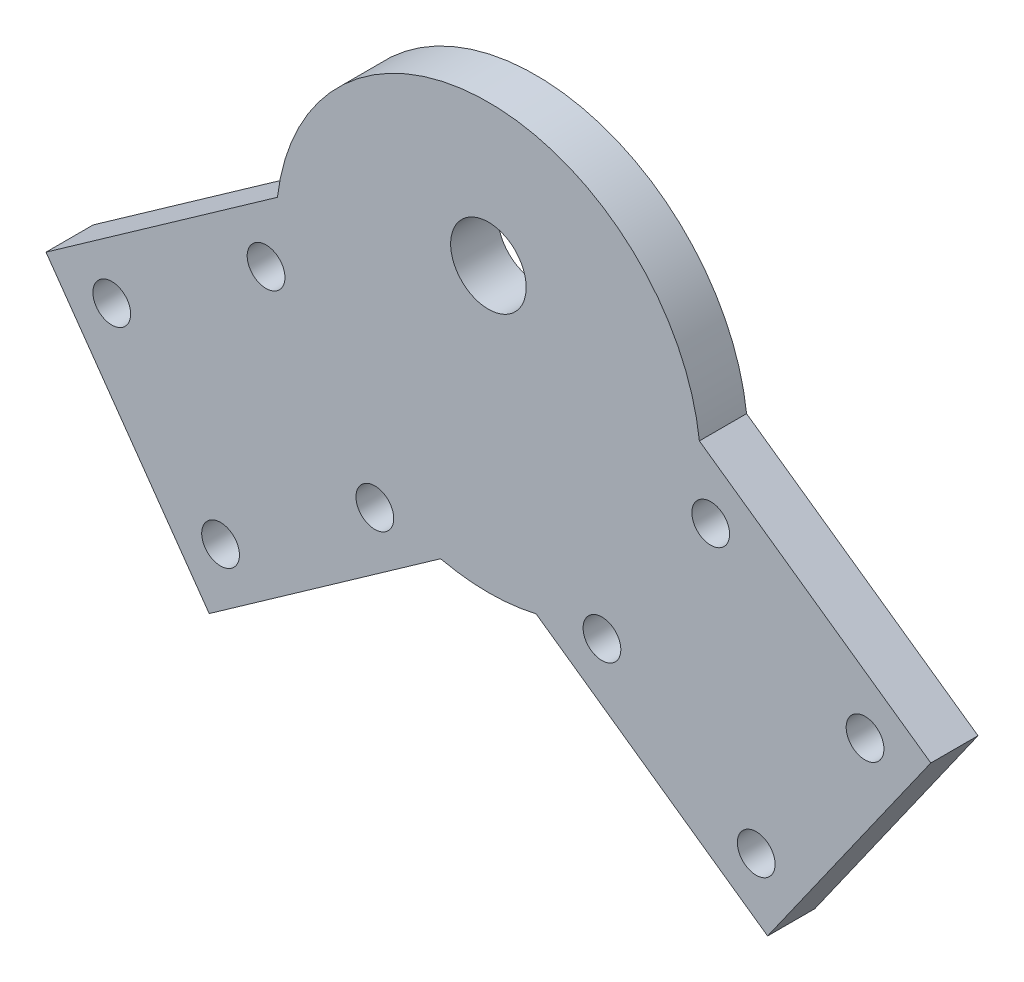
ISO-10303-21;
HEADER;
FILE_DESCRIPTION(('STEP AP214'),'2;1');
FILE_NAME('part.step','',(''),(''),'','','');
FILE_SCHEMA(('AUTOMOTIVE_DESIGN { 1 0 10303 214 1 1 1 1 }'));
ENDSEC;
DATA;
#1=APPLICATION_CONTEXT('core data for automotive mechanical design processes');
#2=APPLICATION_PROTOCOL_DEFINITION('international standard','automotive_design',2000,#1);
#3=PRODUCT_CONTEXT('',#1,'mechanical');
#4=PRODUCT('Part','Part','',(#3));
#5=PRODUCT_RELATED_PRODUCT_CATEGORY('part','',(#4));
#6=PRODUCT_DEFINITION_FORMATION('','',#4);
#7=PRODUCT_DEFINITION_CONTEXT('part definition',#1,'design');
#8=PRODUCT_DEFINITION('design','',#6,#7);
#9=PRODUCT_DEFINITION_SHAPE('','',#8);
#10=(LENGTH_UNIT() NAMED_UNIT(*) SI_UNIT(.MILLI.,.METRE.));
#11=(NAMED_UNIT(*) PLANE_ANGLE_UNIT() SI_UNIT($,.RADIAN.));
#12=(NAMED_UNIT(*) SI_UNIT($,.STERADIAN.) SOLID_ANGLE_UNIT());
#13=UNCERTAINTY_MEASURE_WITH_UNIT(LENGTH_MEASURE(1.E-05),#10,'distance_accuracy_value','');
#14=(GEOMETRIC_REPRESENTATION_CONTEXT(3) GLOBAL_UNCERTAINTY_ASSIGNED_CONTEXT((#13)) GLOBAL_UNIT_ASSIGNED_CONTEXT((#10,
#11,#12)) REPRESENTATION_CONTEXT('',''));
#15=CARTESIAN_POINT('',(0.,0.,0.));
#16=DIRECTION('',(0.,0.,1.));
#17=DIRECTION('',(1.,0.,0.));
#18=AXIS2_PLACEMENT_3D('',#15,#16,#17);
#19=CARTESIAN_POINT('',(0.,0.,0.));
#20=DIRECTION('',(0.,0.,1.));
#21=DIRECTION('',(1.,0.,0.));
#22=AXIS2_PLACEMENT_3D('',#19,#20,#21);
#23=PLANE('',#22);
#24=CARTESIAN_POINT('',(0.,7.5,0.));
#25=DIRECTION('',(0.,0.,1.));
#26=DIRECTION('',(1.,0.,0.));
#27=AXIS2_PLACEMENT_3D('',#24,#25,#26);
#28=CIRCLE('',#27,4.);
#29=CARTESIAN_POINT('',(4.,7.5,0.));
#30=VERTEX_POINT('',#29);
#31=EDGE_CURVE('E247',#30,#30,#28,.T.);
#32=ORIENTED_EDGE('',*,*,#31,.T.);
#33=EDGE_LOOP('',(#32));
#34=FACE_BOUND('',#33,.T.);
#35=CARTESIAN_POINT('',(-39.8997451402914,-15.8992398969955,0.));
#36=DIRECTION('',(0.,0.,1.));
#37=DIRECTION('',(1.,0.,0.));
#38=AXIS2_PLACEMENT_3D('',#35,#36,#37);
#39=CIRCLE('',#38,2.);
#40=CARTESIAN_POINT('',(-37.8997451402914,-15.8992398969955,0.));
#41=VERTEX_POINT('',#40);
#42=EDGE_CURVE('E154',#41,#41,#39,.T.);
#43=ORIENTED_EDGE('',*,*,#42,.T.);
#44=EDGE_LOOP('',(#43));
#45=FACE_BOUND('',#44,.T.);
#46=CARTESIAN_POINT('',(12.0290680062479,-20.7185091455333,0.));
#47=DIRECTION('',(0.,0.,1.));
#48=DIRECTION('',(1.,0.,0.));
#49=AXIS2_PLACEMENT_3D('',#46,#47,#48);
#50=CIRCLE('',#49,2.);
#51=CARTESIAN_POINT('',(14.0290680062479,-20.7185091455333,0.));
#52=VERTEX_POINT('',#51);
#53=EDGE_CURVE('E213',#52,#52,#50,.T.);
#54=ORIENTED_EDGE('',*,*,#53,.T.);
#55=EDGE_LOOP('',(#54));
#56=FACE_BOUND('',#55,.T.);
#57=CARTESIAN_POINT('',(-28.3740411975385,-32.2442130882862,0.));
#58=DIRECTION('',(0.,0.,1.));
#59=DIRECTION('',(1.,0.,0.));
#60=AXIS2_PLACEMENT_3D('',#57,#58,#59);
#61=CIRCLE('',#60,2.00000000000001);
#62=CARTESIAN_POINT('',(-26.3740411975385,-32.2442130882862,0.));
#63=VERTEX_POINT('',#62);
#64=EDGE_CURVE('E217',#63,#63,#61,.T.);
#65=ORIENTED_EDGE('',*,*,#64,.T.);
#66=EDGE_LOOP('',(#65));
#67=FACE_BOUND('',#66,.T.);
#68=CARTESIAN_POINT('',(-12.0290680062479,-20.7185091455333,0.));
#69=DIRECTION('',(0.,0.,1.));
#70=DIRECTION('',(1.,0.,0.));
#71=AXIS2_PLACEMENT_3D('',#68,#69,#70);
#72=CIRCLE('',#71,2.);
#73=CARTESIAN_POINT('',(-10.0290680062479,-20.7185091455333,0.));
#74=VERTEX_POINT('',#73);
#75=EDGE_CURVE('E221',#74,#74,#72,.T.);
#76=ORIENTED_EDGE('',*,*,#75,.T.);
#77=EDGE_LOOP('',(#76));
#78=FACE_BOUND('',#77,.T.);
#79=CARTESIAN_POINT('',(-23.5547719490007,-4.37353595424265,0.));
#80=DIRECTION('',(0.,0.,1.));
#81=DIRECTION('',(1.,0.,0.));
#82=AXIS2_PLACEMENT_3D('',#79,#80,#81);
#83=CIRCLE('',#82,2.);
#84=CARTESIAN_POINT('',(-21.5547719490007,-4.37353595424265,0.));
#85=VERTEX_POINT('',#84);
#86=EDGE_CURVE('E225',#85,#85,#83,.T.);
#87=ORIENTED_EDGE('',*,*,#86,.T.);
#88=EDGE_LOOP('',(#87));
#89=FACE_BOUND('',#88,.T.);
#90=CARTESIAN_POINT('',(23.5547719490007,-4.37353595424265,0.));
#91=DIRECTION('',(0.,0.,1.));
#92=DIRECTION('',(1.,0.,0.));
#93=AXIS2_PLACEMENT_3D('',#90,#91,#92);
#94=CIRCLE('',#93,2.);
#95=CARTESIAN_POINT('',(25.5547719490007,-4.37353595424265,0.));
#96=VERTEX_POINT('',#95);
#97=EDGE_CURVE('E229',#96,#96,#94,.T.);
#98=ORIENTED_EDGE('',*,*,#97,.T.);
#99=EDGE_LOOP('',(#98));
#100=FACE_BOUND('',#99,.T.);
#101=CARTESIAN_POINT('',(39.8997451402914,-15.8992398969955,0.));
#102=DIRECTION('',(0.,0.,1.));
#103=DIRECTION('',(1.,0.,0.));
#104=AXIS2_PLACEMENT_3D('',#101,#102,#103);
#105=CIRCLE('',#104,2.);
#106=CARTESIAN_POINT('',(41.8997451402914,-15.8992398969955,0.));
#107=VERTEX_POINT('',#106);
#108=EDGE_CURVE('E233',#107,#107,#105,.T.);
#109=ORIENTED_EDGE('',*,*,#108,.T.);
#110=EDGE_LOOP('',(#109));
#111=FACE_BOUND('',#110,.T.);
#112=CARTESIAN_POINT('',(28.3740411975385,-32.2442130882862,0.));
#113=DIRECTION('',(0.,0.,1.));
#114=DIRECTION('',(1.,0.,0.));
#115=AXIS2_PLACEMENT_3D('',#112,#113,#114);
#116=CIRCLE('',#115,2.00000000000001);
#117=CARTESIAN_POINT('',(30.3740411975386,-32.2442130882862,0.));
#118=VERTEX_POINT('',#117);
#119=EDGE_CURVE('E237',#118,#118,#116,.T.);
#120=ORIENTED_EDGE('',*,*,#119,.T.);
#121=EDGE_LOOP('',(#120));
#122=FACE_BOUND('',#121,.T.);
#123=CARTESIAN_POINT('',(0.,0.,0.));
#124=DIRECTION('',(0.,0.,1.));
#125=DIRECTION('',(1.,0.,0.));
#126=AXIS2_PLACEMENT_3D('',#123,#124,#125);
#127=CIRCLE('',#126,22.5);
#128=CARTESIAN_POINT('',(22.3499546368663,2.59413332926824,0.));
#129=VERTEX_POINT('',#128);
#130=CARTESIAN_POINT('',(-22.3499546368663,2.59413332926824,0.));
#131=VERTEX_POINT('',#130);
#132=EDGE_CURVE('E202',#129,#131,#127,.T.);
#133=ORIENTED_EDGE('',*,*,#132,.F.);
#134=DIRECTION('',(0.817248659564534,-0.576285197137643,0.));
#135=VECTOR('',#134,1.);
#136=CARTESIAN_POINT('',(22.3499546368663,2.59413332926824,0.));
#137=LINE('',#136,#135);
#138=CARTESIAN_POINT('',(46.8674144238023,-14.6944225848611,0.));
#139=VERTEX_POINT('',#138);
#140=EDGE_CURVE('E150',#129,#139,#137,.T.);
#141=ORIENTED_EDGE('',*,*,#140,.T.);
#142=DIRECTION('',(0.576285197137643,0.817248659564534,0.));
#143=VECTOR('',#142,1.);
#144=CARTESIAN_POINT('',(29.578858509673,-39.2118823717971,0.));
#145=LINE('',#144,#143);
#146=CARTESIAN_POINT('',(29.578858509673,-39.2118823717971,0.));
#147=VERTEX_POINT('',#146);
#148=EDGE_CURVE('E141',#147,#139,#145,.T.);
#149=ORIENTED_EDGE('',*,*,#148,.F.);
#150=DIRECTION('',(0.817248659564534,-0.576285197137643,0.));
#151=VECTOR('',#150,1.);
#152=CARTESIAN_POINT('',(5.06139872273697,-21.9233264576678,0.));
#153=LINE('',#152,#151);
#154=CARTESIAN_POINT('',(5.06139872273697,-21.9233264576678,0.));
#155=VERTEX_POINT('',#154);
#156=EDGE_CURVE('E130',#155,#147,#153,.T.);
#157=ORIENTED_EDGE('',*,*,#156,.F.);
#158=CARTESIAN_POINT('',(-5.06139872273697,-21.9233264576678,0.));
#159=VERTEX_POINT('',#158);
#160=EDGE_CURVE('E167',#159,#155,#127,.T.);
#161=ORIENTED_EDGE('',*,*,#160,.F.);
#162=DIRECTION('',(-0.817248659564534,-0.576285197137643,0.));
#163=VECTOR('',#162,1.);
#164=CARTESIAN_POINT('',(-5.06139872273697,-21.9233264576678,0.));
#165=LINE('',#164,#163);
#166=CARTESIAN_POINT('',(-29.578858509673,-39.2118823717971,0.));
#167=VERTEX_POINT('',#166);
#168=EDGE_CURVE('E172',#159,#167,#165,.T.);
#169=ORIENTED_EDGE('',*,*,#168,.T.);
#170=DIRECTION('',(-0.576285197137643,0.817248659564534,0.));
#171=VECTOR('',#170,1.);
#172=CARTESIAN_POINT('',(-29.578858509673,-39.2118823717971,0.));
#173=LINE('',#172,#171);
#174=CARTESIAN_POINT('',(-46.8674144238023,-14.6944225848611,0.));
#175=VERTEX_POINT('',#174);
#176=EDGE_CURVE('E177',#167,#175,#173,.T.);
#177=ORIENTED_EDGE('',*,*,#176,.T.);
#178=DIRECTION('',(-0.817248659564534,-0.576285197137643,0.));
#179=VECTOR('',#178,1.);
#180=CARTESIAN_POINT('',(-22.3499546368663,2.59413332926823,0.));
#181=LINE('',#180,#179);
#182=EDGE_CURVE('E148',#131,#175,#181,.T.);
#183=ORIENTED_EDGE('',*,*,#182,.F.);
#184=EDGE_LOOP('',(#133,#141,#149,#157,#161,#169,#177,#183));
#185=FACE_BOUND('',#184,.T.);
#186=ADVANCED_FACE('F74',(#34,#45,#56,#67,#78,#89,#100,#111,#122,#185),#23,.F.);
#187=CARTESIAN_POINT('',(0.,0.,5.));
#188=DIRECTION('',(0.,0.,1.));
#189=DIRECTION('',(1.,0.,0.));
#190=AXIS2_PLACEMENT_3D('',#187,#188,#189);
#191=PLANE('',#190);
#192=CARTESIAN_POINT('',(0.,7.5,5.));
#193=DIRECTION('',(0.,0.,1.));
#194=DIRECTION('',(1.,0.,0.));
#195=AXIS2_PLACEMENT_3D('',#192,#193,#194);
#196=CIRCLE('',#195,4.);
#197=CARTESIAN_POINT('',(4.,7.5,5.));
#198=VERTEX_POINT('',#197);
#199=EDGE_CURVE('E277',#198,#198,#196,.T.);
#200=ORIENTED_EDGE('',*,*,#199,.F.);
#201=EDGE_LOOP('',(#200));
#202=FACE_BOUND('',#201,.T.);
#203=CARTESIAN_POINT('',(-39.8997451402914,-15.8992398969955,5.));
#204=DIRECTION('',(0.,0.,1.));
#205=DIRECTION('',(1.,0.,0.));
#206=AXIS2_PLACEMENT_3D('',#203,#204,#205);
#207=CIRCLE('',#206,2.);
#208=CARTESIAN_POINT('',(-37.8997451402914,-15.8992398969955,5.));
#209=VERTEX_POINT('',#208);
#210=EDGE_CURVE('E241',#209,#209,#207,.T.);
#211=ORIENTED_EDGE('',*,*,#210,.F.);
#212=EDGE_LOOP('',(#211));
#213=FACE_BOUND('',#212,.T.);
#214=CARTESIAN_POINT('',(12.0290680062479,-20.7185091455333,5.));
#215=DIRECTION('',(0.,0.,1.));
#216=DIRECTION('',(1.,0.,0.));
#217=AXIS2_PLACEMENT_3D('',#214,#215,#216);
#218=CIRCLE('',#217,2.);
#219=CARTESIAN_POINT('',(14.0290680062479,-20.7185091455333,5.));
#220=VERTEX_POINT('',#219);
#221=EDGE_CURVE('E255',#220,#220,#218,.T.);
#222=ORIENTED_EDGE('',*,*,#221,.F.);
#223=EDGE_LOOP('',(#222));
#224=FACE_BOUND('',#223,.T.);
#225=CARTESIAN_POINT('',(-28.3740411975385,-32.2442130882862,5.));
#226=DIRECTION('',(0.,0.,1.));
#227=DIRECTION('',(1.,0.,0.));
#228=AXIS2_PLACEMENT_3D('',#225,#226,#227);
#229=CIRCLE('',#228,2.00000000000001);
#230=CARTESIAN_POINT('',(-26.3740411975385,-32.2442130882862,5.));
#231=VERTEX_POINT('',#230);
#232=EDGE_CURVE('E261',#231,#231,#229,.T.);
#233=ORIENTED_EDGE('',*,*,#232,.F.);
#234=EDGE_LOOP('',(#233));
#235=FACE_BOUND('',#234,.T.);
#236=CARTESIAN_POINT('',(-12.0290680062479,-20.7185091455333,5.));
#237=DIRECTION('',(0.,0.,1.));
#238=DIRECTION('',(1.,0.,0.));
#239=AXIS2_PLACEMENT_3D('',#236,#237,#238);
#240=CIRCLE('',#239,2.);
#241=CARTESIAN_POINT('',(-10.0290680062479,-20.7185091455333,5.));
#242=VERTEX_POINT('',#241);
#243=EDGE_CURVE('E256',#242,#242,#240,.T.);
#244=ORIENTED_EDGE('',*,*,#243,.F.);
#245=EDGE_LOOP('',(#244));
#246=FACE_BOUND('',#245,.T.);
#247=CARTESIAN_POINT('',(-23.5547719490007,-4.37353595424265,5.));
#248=DIRECTION('',(0.,0.,1.));
#249=DIRECTION('',(1.,0.,0.));
#250=AXIS2_PLACEMENT_3D('',#247,#248,#249);
#251=CIRCLE('',#250,2.);
#252=CARTESIAN_POINT('',(-21.5547719490007,-4.37353595424265,5.));
#253=VERTEX_POINT('',#252);
#254=EDGE_CURVE('E260',#253,#253,#251,.T.);
#255=ORIENTED_EDGE('',*,*,#254,.F.);
#256=EDGE_LOOP('',(#255));
#257=FACE_BOUND('',#256,.T.);
#258=CARTESIAN_POINT('',(23.5547719490007,-4.37353595424265,5.));
#259=DIRECTION('',(0.,0.,1.));
#260=DIRECTION('',(1.,0.,0.));
#261=AXIS2_PLACEMENT_3D('',#258,#259,#260);
#262=CIRCLE('',#261,2.);
#263=CARTESIAN_POINT('',(25.5547719490007,-4.37353595424265,5.));
#264=VERTEX_POINT('',#263);
#265=EDGE_CURVE('E251',#264,#264,#262,.T.);
#266=ORIENTED_EDGE('',*,*,#265,.F.);
#267=EDGE_LOOP('',(#266));
#268=FACE_BOUND('',#267,.T.);
#269=CARTESIAN_POINT('',(39.8997451402914,-15.8992398969955,5.));
#270=DIRECTION('',(0.,0.,1.));
#271=DIRECTION('',(1.,0.,0.));
#272=AXIS2_PLACEMENT_3D('',#269,#270,#271);
#273=CIRCLE('',#272,2.);
#274=CARTESIAN_POINT('',(41.8997451402914,-15.8992398969955,5.));
#275=VERTEX_POINT('',#274);
#276=EDGE_CURVE('E246',#275,#275,#273,.T.);
#277=ORIENTED_EDGE('',*,*,#276,.F.);
#278=EDGE_LOOP('',(#277));
#279=FACE_BOUND('',#278,.T.);
#280=CARTESIAN_POINT('',(28.3740411975385,-32.2442130882862,5.));
#281=DIRECTION('',(0.,0.,1.));
#282=DIRECTION('',(1.,0.,0.));
#283=AXIS2_PLACEMENT_3D('',#280,#281,#282);
#284=CIRCLE('',#283,2.00000000000001);
#285=CARTESIAN_POINT('',(30.3740411975386,-32.2442130882862,5.));
#286=VERTEX_POINT('',#285);
#287=EDGE_CURVE('E242',#286,#286,#284,.T.);
#288=ORIENTED_EDGE('',*,*,#287,.F.);
#289=EDGE_LOOP('',(#288));
#290=FACE_BOUND('',#289,.T.);
#291=CARTESIAN_POINT('',(0.,0.,5.));
#292=DIRECTION('',(0.,0.,1.));
#293=DIRECTION('',(1.,0.,0.));
#294=AXIS2_PLACEMENT_3D('',#291,#292,#293);
#295=CIRCLE('',#294,22.5);
#296=CARTESIAN_POINT('',(-5.06139872273697,-21.9233264576678,5.));
#297=VERTEX_POINT('',#296);
#298=CARTESIAN_POINT('',(5.06139872273697,-21.9233264576678,5.));
#299=VERTEX_POINT('',#298);
#300=EDGE_CURVE('E206',#297,#299,#295,.T.);
#301=ORIENTED_EDGE('',*,*,#300,.T.);
#302=DIRECTION('',(0.817248659564534,-0.576285197137643,0.));
#303=VECTOR('',#302,1.);
#304=CARTESIAN_POINT('',(5.06139872273697,-21.9233264576678,5.));
#305=LINE('',#304,#303);
#306=CARTESIAN_POINT('',(29.578858509673,-39.2118823717971,5.));
#307=VERTEX_POINT('',#306);
#308=EDGE_CURVE('E157',#299,#307,#305,.T.);
#309=ORIENTED_EDGE('',*,*,#308,.T.);
#310=DIRECTION('',(0.576285197137643,0.817248659564534,0.));
#311=VECTOR('',#310,1.);
#312=CARTESIAN_POINT('',(29.578858509673,-39.2118823717971,5.));
#313=LINE('',#312,#311);
#314=CARTESIAN_POINT('',(46.8674144238023,-14.6944225848611,5.));
#315=VERTEX_POINT('',#314);
#316=EDGE_CURVE('E146',#307,#315,#313,.T.);
#317=ORIENTED_EDGE('',*,*,#316,.T.);
#318=DIRECTION('',(0.817248659564534,-0.576285197137643,0.));
#319=VECTOR('',#318,1.);
#320=CARTESIAN_POINT('',(22.3499546368663,2.59413332926824,5.));
#321=LINE('',#320,#319);
#322=CARTESIAN_POINT('',(22.3499546368663,2.59413332926824,5.));
#323=VERTEX_POINT('',#322);
#324=EDGE_CURVE('E140',#323,#315,#321,.T.);
#325=ORIENTED_EDGE('',*,*,#324,.F.);
#326=CARTESIAN_POINT('',(-22.3499546368663,2.59413332926824,5.));
#327=VERTEX_POINT('',#326);
#328=EDGE_CURVE('E201',#323,#327,#295,.T.);
#329=ORIENTED_EDGE('',*,*,#328,.T.);
#330=DIRECTION('',(-0.817248659564534,-0.576285197137643,0.));
#331=VECTOR('',#330,1.);
#332=CARTESIAN_POINT('',(-22.3499546368663,2.59413332926823,5.));
#333=LINE('',#332,#331);
#334=CARTESIAN_POINT('',(-46.8674144238023,-14.6944225848611,5.));
#335=VERTEX_POINT('',#334);
#336=EDGE_CURVE('E176',#327,#335,#333,.T.);
#337=ORIENTED_EDGE('',*,*,#336,.T.);
#338=DIRECTION('',(-0.576285197137643,0.817248659564534,0.));
#339=VECTOR('',#338,1.);
#340=CARTESIAN_POINT('',(-29.578858509673,-39.2118823717971,5.));
#341=LINE('',#340,#339);
#342=CARTESIAN_POINT('',(-29.578858509673,-39.2118823717971,5.));
#343=VERTEX_POINT('',#342);
#344=EDGE_CURVE('E187',#343,#335,#341,.T.);
#345=ORIENTED_EDGE('',*,*,#344,.F.);
#346=DIRECTION('',(-0.817248659564534,-0.576285197137643,0.));
#347=VECTOR('',#346,1.);
#348=CARTESIAN_POINT('',(-5.06139872273697,-21.9233264576678,5.));
#349=LINE('',#348,#347);
#350=EDGE_CURVE('E171',#297,#343,#349,.T.);
#351=ORIENTED_EDGE('',*,*,#350,.F.);
#352=EDGE_LOOP('',(#301,#309,#317,#325,#329,#337,#345,#351));
#353=FACE_BOUND('',#352,.T.);
#354=ADVANCED_FACE('F285',(#202,#213,#224,#235,#246,#257,#268,#279,#290,#353),#191,.T.);
#355=CARTESIAN_POINT('',(0.,0.,5.));
#356=DIRECTION('',(0.,0.,-1.));
#357=DIRECTION('',(-1.,0.,0.));
#358=AXIS2_PLACEMENT_3D('',#355,#356,#357);
#359=CYLINDRICAL_SURFACE('',#358,22.5);
#360=DIRECTION('',(0.,0.,-1.));
#361=VECTOR('',#360,1.);
#362=CARTESIAN_POINT('',(-22.3499546368663,2.59413332926824,5.));
#363=LINE('',#362,#361);
#364=EDGE_CURVE('E12',#327,#131,#363,.T.);
#365=ORIENTED_EDGE('',*,*,#364,.F.);
#366=ORIENTED_EDGE('',*,*,#328,.F.);
#367=DIRECTION('',(0.,0.,-1.));
#368=VECTOR('',#367,1.);
#369=CARTESIAN_POINT('',(22.3499546368663,2.59413332926824,5.));
#370=LINE('',#369,#368);
#371=EDGE_CURVE('E195',#323,#129,#370,.T.);
#372=ORIENTED_EDGE('',*,*,#371,.T.);
#373=ORIENTED_EDGE('',*,*,#132,.T.);
#374=EDGE_LOOP('',(#365,#366,#372,#373));
#375=FACE_BOUND('',#374,.T.);
#376=ADVANCED_FACE('F288',(#375),#359,.T.);
#377=DIRECTION('',(0.,0.,-1.));
#378=VECTOR('',#377,1.);
#379=CARTESIAN_POINT('',(-5.06139872273697,-21.9233264576678,5.));
#380=LINE('',#379,#378);
#381=EDGE_CURVE('E85',#159,#297,#380,.F.);
#382=ORIENTED_EDGE('',*,*,#381,.F.);
#383=ORIENTED_EDGE('',*,*,#160,.T.);
#384=DIRECTION('',(0.,0.,-1.));
#385=VECTOR('',#384,1.);
#386=CARTESIAN_POINT('',(5.06139872273697,-21.9233264576678,5.));
#387=LINE('',#386,#385);
#388=EDGE_CURVE('E94',#299,#155,#387,.T.);
#389=ORIENTED_EDGE('',*,*,#388,.F.);
#390=ORIENTED_EDGE('',*,*,#300,.F.);
#391=EDGE_LOOP('',(#382,#383,#389,#390));
#392=FACE_BOUND('',#391,.T.);
#393=ADVANCED_FACE('F315',(#392),#359,.T.);
#394=CARTESIAN_POINT('',(29.578858509673,-39.2118823717971,5.));
#395=DIRECTION('',(-0.817248659564534,0.576285197137643,0.));
#396=DIRECTION('',(-0.576285197137643,-0.817248659564535,0.));
#397=AXIS2_PLACEMENT_3D('',#394,#395,#396);
#398=PLANE('',#397);
#399=ORIENTED_EDGE('',*,*,#148,.T.);
#400=DIRECTION('',(0.,0.,-1.));
#401=VECTOR('',#400,1.);
#402=CARTESIAN_POINT('',(46.8674144238023,-14.6944225848611,5.));
#403=LINE('',#402,#401);
#404=EDGE_CURVE('E78',#315,#139,#403,.T.);
#405=ORIENTED_EDGE('',*,*,#404,.F.);
#406=ORIENTED_EDGE('',*,*,#316,.F.);
#407=DIRECTION('',(0.,0.,-1.));
#408=VECTOR('',#407,1.);
#409=CARTESIAN_POINT('',(29.578858509673,-39.2118823717971,5.));
#410=LINE('',#409,#408);
#411=EDGE_CURVE('E133',#307,#147,#410,.T.);
#412=ORIENTED_EDGE('',*,*,#411,.T.);
#413=EDGE_LOOP('',(#399,#405,#406,#412));
#414=FACE_BOUND('',#413,.T.);
#415=ADVANCED_FACE('F144',(#414),#398,.F.);
#416=CARTESIAN_POINT('',(22.3499546368663,2.59413332926824,5.));
#417=DIRECTION('',(0.576285197137643,0.817248659564534,0.));
#418=DIRECTION('',(-0.817248659564534,0.576285197137643,0.));
#419=AXIS2_PLACEMENT_3D('',#416,#417,#418);
#420=PLANE('',#419);
#421=ORIENTED_EDGE('',*,*,#140,.F.);
#422=ORIENTED_EDGE('',*,*,#371,.F.);
#423=ORIENTED_EDGE('',*,*,#324,.T.);
#424=ORIENTED_EDGE('',*,*,#404,.T.);
#425=EDGE_LOOP('',(#421,#422,#423,#424));
#426=FACE_BOUND('',#425,.T.);
#427=ADVANCED_FACE('F76',(#426),#420,.T.);
#428=CARTESIAN_POINT('',(5.06139872273697,-21.9233264576678,5.));
#429=DIRECTION('',(0.576285197137643,0.817248659564534,0.));
#430=DIRECTION('',(-0.817248659564534,0.576285197137643,0.));
#431=AXIS2_PLACEMENT_3D('',#428,#429,#430);
#432=PLANE('',#431);
#433=ORIENTED_EDGE('',*,*,#156,.T.);
#434=ORIENTED_EDGE('',*,*,#411,.F.);
#435=ORIENTED_EDGE('',*,*,#308,.F.);
#436=ORIENTED_EDGE('',*,*,#388,.T.);
#437=EDGE_LOOP('',(#433,#434,#435,#436));
#438=FACE_BOUND('',#437,.T.);
#439=ADVANCED_FACE('F132',(#438),#432,.F.);
#440=CARTESIAN_POINT('',(-29.578858509673,-39.2118823717971,5.));
#441=DIRECTION('',(-0.817248659564534,-0.576285197137643,0.));
#442=DIRECTION('',(0.576285197137643,-0.817248659564534,0.));
#443=AXIS2_PLACEMENT_3D('',#440,#441,#442);
#444=PLANE('',#443);
#445=ORIENTED_EDGE('',*,*,#176,.F.);
#446=DIRECTION('',(0.,0.,-1.));
#447=VECTOR('',#446,1.);
#448=CARTESIAN_POINT('',(-29.578858509673,-39.2118823717971,5.));
#449=LINE('',#448,#447);
#450=EDGE_CURVE('E168',#343,#167,#449,.T.);
#451=ORIENTED_EDGE('',*,*,#450,.F.);
#452=ORIENTED_EDGE('',*,*,#344,.T.);
#453=DIRECTION('',(0.,0.,-1.));
#454=VECTOR('',#453,1.);
#455=CARTESIAN_POINT('',(-46.8674144238023,-14.6944225848611,5.));
#456=LINE('',#455,#454);
#457=EDGE_CURVE('E164',#335,#175,#456,.T.);
#458=ORIENTED_EDGE('',*,*,#457,.T.);
#459=EDGE_LOOP('',(#445,#451,#452,#458));
#460=FACE_BOUND('',#459,.T.);
#461=ADVANCED_FACE('F337',(#460),#444,.T.);
#462=CARTESIAN_POINT('',(-5.06139872273697,-21.9233264576678,5.));
#463=DIRECTION('',(0.576285197137643,-0.817248659564534,0.));
#464=DIRECTION('',(0.817248659564534,0.576285197137643,0.));
#465=AXIS2_PLACEMENT_3D('',#462,#463,#464);
#466=PLANE('',#465);
#467=ORIENTED_EDGE('',*,*,#168,.F.);
#468=ORIENTED_EDGE('',*,*,#381,.T.);
#469=ORIENTED_EDGE('',*,*,#350,.T.);
#470=ORIENTED_EDGE('',*,*,#450,.T.);
#471=EDGE_LOOP('',(#467,#468,#469,#470));
#472=FACE_BOUND('',#471,.T.);
#473=ADVANCED_FACE('F291',(#472),#466,.T.);
#474=CARTESIAN_POINT('',(-22.3499546368663,2.59413332926823,5.));
#475=DIRECTION('',(0.576285197137643,-0.817248659564534,0.));
#476=DIRECTION('',(0.817248659564534,0.576285197137643,0.));
#477=AXIS2_PLACEMENT_3D('',#474,#475,#476);
#478=PLANE('',#477);
#479=ORIENTED_EDGE('',*,*,#182,.T.);
#480=ORIENTED_EDGE('',*,*,#457,.F.);
#481=ORIENTED_EDGE('',*,*,#336,.F.);
#482=ORIENTED_EDGE('',*,*,#364,.T.);
#483=EDGE_LOOP('',(#479,#480,#481,#482));
#484=FACE_BOUND('',#483,.T.);
#485=ADVANCED_FACE('F333',(#484),#478,.F.);
#486=CARTESIAN_POINT('',(28.3740411975385,-32.2442130882862,-5.));
#487=DIRECTION('',(0.,0.,1.));
#488=DIRECTION('',(1.,0.,0.));
#489=AXIS2_PLACEMENT_3D('',#486,#487,#488);
#490=CYLINDRICAL_SURFACE('',#489,2.00000000000001);
#491=ORIENTED_EDGE('',*,*,#287,.T.);
#492=EDGE_LOOP('',(#491));
#493=FACE_BOUND('',#492,.T.);
#494=ORIENTED_EDGE('',*,*,#119,.F.);
#495=EDGE_LOOP('',(#494));
#496=FACE_BOUND('',#495,.T.);
#497=ADVANCED_FACE('F290',(#493,#496),#490,.F.);
#498=CARTESIAN_POINT('',(39.8997451402914,-15.8992398969955,-5.));
#499=DIRECTION('',(0.,0.,1.));
#500=DIRECTION('',(1.,0.,0.));
#501=AXIS2_PLACEMENT_3D('',#498,#499,#500);
#502=CYLINDRICAL_SURFACE('',#501,2.);
#503=ORIENTED_EDGE('',*,*,#276,.T.);
#504=EDGE_LOOP('',(#503));
#505=FACE_BOUND('',#504,.T.);
#506=ORIENTED_EDGE('',*,*,#108,.F.);
#507=EDGE_LOOP('',(#506));
#508=FACE_BOUND('',#507,.T.);
#509=ADVANCED_FACE('F394',(#505,#508),#502,.F.);
#510=CARTESIAN_POINT('',(23.5547719490007,-4.37353595424265,-5.));
#511=DIRECTION('',(0.,0.,1.));
#512=DIRECTION('',(1.,0.,0.));
#513=AXIS2_PLACEMENT_3D('',#510,#511,#512);
#514=CYLINDRICAL_SURFACE('',#513,2.);
#515=ORIENTED_EDGE('',*,*,#265,.T.);
#516=EDGE_LOOP('',(#515));
#517=FACE_BOUND('',#516,.T.);
#518=ORIENTED_EDGE('',*,*,#97,.F.);
#519=EDGE_LOOP('',(#518));
#520=FACE_BOUND('',#519,.T.);
#521=ADVANCED_FACE('F404',(#517,#520),#514,.F.);
#522=CARTESIAN_POINT('',(-23.5547719490007,-4.37353595424265,-5.));
#523=DIRECTION('',(0.,0.,1.));
#524=DIRECTION('',(1.,0.,0.));
#525=AXIS2_PLACEMENT_3D('',#522,#523,#524);
#526=CYLINDRICAL_SURFACE('',#525,2.);
#527=ORIENTED_EDGE('',*,*,#254,.T.);
#528=EDGE_LOOP('',(#527));
#529=FACE_BOUND('',#528,.T.);
#530=ORIENTED_EDGE('',*,*,#86,.F.);
#531=EDGE_LOOP('',(#530));
#532=FACE_BOUND('',#531,.T.);
#533=ADVANCED_FACE('F414',(#529,#532),#526,.F.);
#534=CARTESIAN_POINT('',(-12.0290680062479,-20.7185091455333,-5.));
#535=DIRECTION('',(0.,0.,1.));
#536=DIRECTION('',(1.,0.,0.));
#537=AXIS2_PLACEMENT_3D('',#534,#535,#536);
#538=CYLINDRICAL_SURFACE('',#537,2.);
#539=ORIENTED_EDGE('',*,*,#243,.T.);
#540=EDGE_LOOP('',(#539));
#541=FACE_BOUND('',#540,.T.);
#542=ORIENTED_EDGE('',*,*,#75,.F.);
#543=EDGE_LOOP('',(#542));
#544=FACE_BOUND('',#543,.T.);
#545=ADVANCED_FACE('F424',(#541,#544),#538,.F.);
#546=CARTESIAN_POINT('',(-28.3740411975385,-32.2442130882862,-5.));
#547=DIRECTION('',(0.,0.,1.));
#548=DIRECTION('',(1.,0.,0.));
#549=AXIS2_PLACEMENT_3D('',#546,#547,#548);
#550=CYLINDRICAL_SURFACE('',#549,2.00000000000001);
#551=ORIENTED_EDGE('',*,*,#232,.T.);
#552=EDGE_LOOP('',(#551));
#553=FACE_BOUND('',#552,.T.);
#554=ORIENTED_EDGE('',*,*,#64,.F.);
#555=EDGE_LOOP('',(#554));
#556=FACE_BOUND('',#555,.T.);
#557=ADVANCED_FACE('F434',(#553,#556),#550,.F.);
#558=CARTESIAN_POINT('',(12.0290680062479,-20.7185091455333,-5.));
#559=DIRECTION('',(0.,0.,1.));
#560=DIRECTION('',(1.,0.,0.));
#561=AXIS2_PLACEMENT_3D('',#558,#559,#560);
#562=CYLINDRICAL_SURFACE('',#561,2.);
#563=ORIENTED_EDGE('',*,*,#221,.T.);
#564=EDGE_LOOP('',(#563));
#565=FACE_BOUND('',#564,.T.);
#566=ORIENTED_EDGE('',*,*,#53,.F.);
#567=EDGE_LOOP('',(#566));
#568=FACE_BOUND('',#567,.T.);
#569=ADVANCED_FACE('F444',(#565,#568),#562,.F.);
#570=CARTESIAN_POINT('',(-39.8997451402914,-15.8992398969955,-5.));
#571=DIRECTION('',(0.,0.,1.));
#572=DIRECTION('',(1.,0.,0.));
#573=AXIS2_PLACEMENT_3D('',#570,#571,#572);
#574=CYLINDRICAL_SURFACE('',#573,2.);
#575=ORIENTED_EDGE('',*,*,#210,.T.);
#576=EDGE_LOOP('',(#575));
#577=FACE_BOUND('',#576,.T.);
#578=ORIENTED_EDGE('',*,*,#42,.F.);
#579=EDGE_LOOP('',(#578));
#580=FACE_BOUND('',#579,.T.);
#581=ADVANCED_FACE('F454',(#577,#580),#574,.F.);
#582=CARTESIAN_POINT('',(0.,7.5,-5.));
#583=DIRECTION('',(0.,0.,1.));
#584=DIRECTION('',(1.,0.,0.));
#585=AXIS2_PLACEMENT_3D('',#582,#583,#584);
#586=CYLINDRICAL_SURFACE('',#585,4.);
#587=ORIENTED_EDGE('',*,*,#199,.T.);
#588=EDGE_LOOP('',(#587));
#589=FACE_BOUND('',#588,.T.);
#590=ORIENTED_EDGE('',*,*,#31,.F.);
#591=EDGE_LOOP('',(#590));
#592=FACE_BOUND('',#591,.T.);
#593=ADVANCED_FACE('F282',(#589,#592),#586,.F.);
#594=CLOSED_SHELL('',(#186,#354,#376,#393,#415,#427,#439,#461,#473,#485,#497,#509,#521,#533,
#545,#557,#569,#581,#593));
#595=MANIFOLD_SOLID_BREP('B2',#594);
#596=ADVANCED_BREP_SHAPE_REPRESENTATION('',(#18,#595),#14);
#597=SHAPE_DEFINITION_REPRESENTATION(#9,#596);
ENDSEC;
END-ISO-10303-21;
